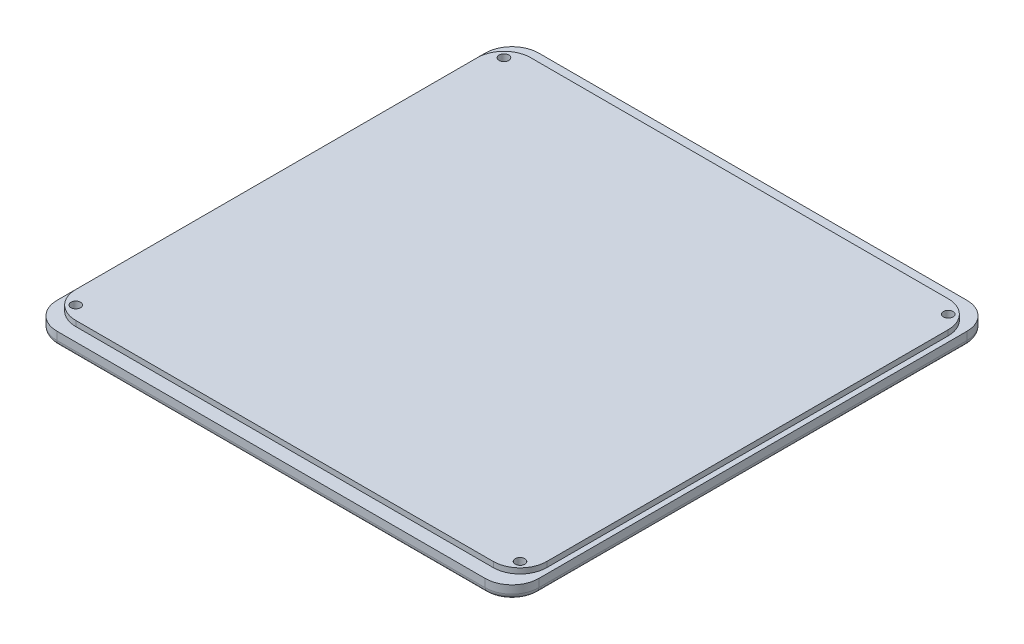
ISO-10303-21;
HEADER;
FILE_DESCRIPTION(('STEP AP214'),'2;1');
FILE_NAME('part.step','',(''),(''),'','','');
FILE_SCHEMA(('AUTOMOTIVE_DESIGN { 1 0 10303 214 1 1 1 1 }'));
ENDSEC;
DATA;
#1=APPLICATION_CONTEXT('core data for automotive mechanical design processes');
#2=APPLICATION_PROTOCOL_DEFINITION('international standard','automotive_design',2000,#1);
#3=PRODUCT_CONTEXT('',#1,'mechanical');
#4=PRODUCT('Part','Part','',(#3));
#5=PRODUCT_RELATED_PRODUCT_CATEGORY('part','',(#4));
#6=PRODUCT_DEFINITION_FORMATION('','',#4);
#7=PRODUCT_DEFINITION_CONTEXT('part definition',#1,'design');
#8=PRODUCT_DEFINITION('design','',#6,#7);
#9=PRODUCT_DEFINITION_SHAPE('','',#8);
#10=(LENGTH_UNIT() NAMED_UNIT(*) SI_UNIT(.MILLI.,.METRE.));
#11=(NAMED_UNIT(*) PLANE_ANGLE_UNIT() SI_UNIT($,.RADIAN.));
#12=(NAMED_UNIT(*) SI_UNIT($,.STERADIAN.) SOLID_ANGLE_UNIT());
#13=UNCERTAINTY_MEASURE_WITH_UNIT(LENGTH_MEASURE(1.E-05),#10,'distance_accuracy_value','');
#14=(GEOMETRIC_REPRESENTATION_CONTEXT(3) GLOBAL_UNCERTAINTY_ASSIGNED_CONTEXT((#13)) GLOBAL_UNIT_ASSIGNED_CONTEXT((#10,
#11,#12)) REPRESENTATION_CONTEXT('',''));
#15=CARTESIAN_POINT('',(0.,0.,0.));
#16=DIRECTION('',(0.,0.,1.));
#17=DIRECTION('',(1.,0.,0.));
#18=AXIS2_PLACEMENT_3D('',#15,#16,#17);
#19=CARTESIAN_POINT('',(90.,5.,-90.));
#20=DIRECTION('',(0.,0.,1.));
#21=DIRECTION('',(1.,0.,0.));
#22=AXIS2_PLACEMENT_3D('',#19,#20,#21);
#23=PLANE('',#22);
#24=DIRECTION('',(0.,-1.,0.));
#25=VECTOR('',#24,1.);
#26=CARTESIAN_POINT('',(80.,0.,-90.));
#27=LINE('',#26,#25);
#28=CARTESIAN_POINT('',(80.,5.,-90.));
#29=VERTEX_POINT('',#28);
#30=CARTESIAN_POINT('',(80.,2.,-90.));
#31=VERTEX_POINT('',#30);
#32=EDGE_CURVE('E259',#29,#31,#27,.T.);
#33=ORIENTED_EDGE('',*,*,#32,.T.);
#34=DIRECTION('',(-1.,0.,0.));
#35=VECTOR('',#34,1.);
#36=CARTESIAN_POINT('',(90.,2.,-90.));
#37=LINE('',#36,#35);
#38=CARTESIAN_POINT('',(-80.,2.,-90.));
#39=VERTEX_POINT('',#38);
#40=EDGE_CURVE('E284',#31,#39,#37,.T.);
#41=ORIENTED_EDGE('',*,*,#40,.T.);
#42=DIRECTION('',(0.,-1.,0.));
#43=VECTOR('',#42,1.);
#44=CARTESIAN_POINT('',(-80.,5.,-90.));
#45=LINE('',#44,#43);
#46=CARTESIAN_POINT('',(-79.9999999999999,5.,-90.));
#47=VERTEX_POINT('',#46);
#48=EDGE_CURVE('E262',#39,#47,#45,.F.);
#49=ORIENTED_EDGE('',*,*,#48,.T.);
#50=DIRECTION('',(-1.,0.,0.));
#51=VECTOR('',#50,1.);
#52=CARTESIAN_POINT('',(90.,5.,-90.));
#53=LINE('',#52,#51);
#54=EDGE_CURVE('E202',#29,#47,#53,.T.);
#55=ORIENTED_EDGE('',*,*,#54,.F.);
#56=EDGE_LOOP('',(#33,#41,#49,#55));
#57=FACE_BOUND('',#56,.T.);
#58=ADVANCED_FACE('F38',(#57),#23,.F.);
#59=CARTESIAN_POINT('',(-90.,5.,-90.));
#60=DIRECTION('',(1.,0.,0.));
#61=DIRECTION('',(0.,0.,-1.));
#62=AXIS2_PLACEMENT_3D('',#59,#60,#61);
#63=PLANE('',#62);
#64=DIRECTION('',(0.,-1.,0.));
#65=VECTOR('',#64,1.);
#66=CARTESIAN_POINT('',(-90.,5.,-80.));
#67=LINE('',#66,#65);
#68=CARTESIAN_POINT('',(-90.,5.,-80.));
#69=VERTEX_POINT('',#68);
#70=CARTESIAN_POINT('',(-90.,2.,-80.));
#71=VERTEX_POINT('',#70);
#72=EDGE_CURVE('E254',#69,#71,#67,.T.);
#73=ORIENTED_EDGE('',*,*,#72,.T.);
#74=DIRECTION('',(0.,0.,1.));
#75=VECTOR('',#74,1.);
#76=CARTESIAN_POINT('',(-90.,2.,-90.));
#77=LINE('',#76,#75);
#78=CARTESIAN_POINT('',(-90.,2.,80.));
#79=VERTEX_POINT('',#78);
#80=EDGE_CURVE('E288',#71,#79,#77,.T.);
#81=ORIENTED_EDGE('',*,*,#80,.T.);
#82=DIRECTION('',(0.,-1.,0.));
#83=VECTOR('',#82,1.);
#84=CARTESIAN_POINT('',(-90.,5.,80.));
#85=LINE('',#84,#83);
#86=CARTESIAN_POINT('',(-90.,5.,79.9999999999999));
#87=VERTEX_POINT('',#86);
#88=EDGE_CURVE('E257',#79,#87,#85,.F.);
#89=ORIENTED_EDGE('',*,*,#88,.T.);
#90=DIRECTION('',(0.,0.,1.));
#91=VECTOR('',#90,1.);
#92=CARTESIAN_POINT('',(-90.,5.,-90.));
#93=LINE('',#92,#91);
#94=EDGE_CURVE('E205',#69,#87,#93,.T.);
#95=ORIENTED_EDGE('',*,*,#94,.F.);
#96=EDGE_LOOP('',(#73,#81,#89,#95));
#97=FACE_BOUND('',#96,.T.);
#98=ADVANCED_FACE('F430',(#97),#63,.F.);
#99=CARTESIAN_POINT('',(90.,5.,90.));
#100=DIRECTION('',(0.,0.,1.));
#101=DIRECTION('',(1.,0.,0.));
#102=AXIS2_PLACEMENT_3D('',#99,#100,#101);
#103=PLANE('',#102);
#104=DIRECTION('',(0.,-1.,0.));
#105=VECTOR('',#104,1.);
#106=CARTESIAN_POINT('',(-80.,0.,90.));
#107=LINE('',#106,#105);
#108=CARTESIAN_POINT('',(-79.9999999999999,5.,90.));
#109=VERTEX_POINT('',#108);
#110=CARTESIAN_POINT('',(-80.,2.,90.));
#111=VERTEX_POINT('',#110);
#112=EDGE_CURVE('E242',#109,#111,#107,.T.);
#113=ORIENTED_EDGE('',*,*,#112,.T.);
#114=DIRECTION('',(-1.,0.,0.));
#115=VECTOR('',#114,1.);
#116=CARTESIAN_POINT('',(80.,2.,90.));
#117=LINE('',#116,#115);
#118=CARTESIAN_POINT('',(80.,2.,90.));
#119=VERTEX_POINT('',#118);
#120=EDGE_CURVE('E62',#111,#119,#117,.F.);
#121=ORIENTED_EDGE('',*,*,#120,.T.);
#122=DIRECTION('',(0.,-1.,0.));
#123=VECTOR('',#122,1.);
#124=CARTESIAN_POINT('',(80.,5.,90.));
#125=LINE('',#124,#123);
#126=CARTESIAN_POINT('',(80.,5.,90.));
#127=VERTEX_POINT('',#126);
#128=EDGE_CURVE('E244',#119,#127,#125,.F.);
#129=ORIENTED_EDGE('',*,*,#128,.T.);
#130=DIRECTION('',(-1.,0.,0.));
#131=VECTOR('',#130,1.);
#132=CARTESIAN_POINT('',(90.,5.,90.));
#133=LINE('',#132,#131);
#134=EDGE_CURVE('E213',#127,#109,#133,.T.);
#135=ORIENTED_EDGE('',*,*,#134,.T.);
#136=EDGE_LOOP('',(#113,#121,#129,#135));
#137=FACE_BOUND('',#136,.T.);
#138=ADVANCED_FACE('F436',(#137),#103,.T.);
#139=CARTESIAN_POINT('',(90.,5.,-90.));
#140=DIRECTION('',(1.,0.,0.));
#141=DIRECTION('',(0.,0.,-1.));
#142=AXIS2_PLACEMENT_3D('',#139,#140,#141);
#143=PLANE('',#142);
#144=DIRECTION('',(0.,-1.,0.));
#145=VECTOR('',#144,1.);
#146=CARTESIAN_POINT('',(90.,5.,80.));
#147=LINE('',#146,#145);
#148=CARTESIAN_POINT('',(90.,5.,79.9999999999999));
#149=VERTEX_POINT('',#148);
#150=CARTESIAN_POINT('',(90.,2.,80.));
#151=VERTEX_POINT('',#150);
#152=EDGE_CURVE('E240',#149,#151,#147,.T.);
#153=ORIENTED_EDGE('',*,*,#152,.T.);
#154=DIRECTION('',(0.,0.,1.));
#155=VECTOR('',#154,1.);
#156=CARTESIAN_POINT('',(90.,2.,-80.));
#157=LINE('',#156,#155);
#158=CARTESIAN_POINT('',(90.,2.,-80.));
#159=VERTEX_POINT('',#158);
#160=EDGE_CURVE('E11',#151,#159,#157,.F.);
#161=ORIENTED_EDGE('',*,*,#160,.T.);
#162=DIRECTION('',(0.,-1.,0.));
#163=VECTOR('',#162,1.);
#164=CARTESIAN_POINT('',(90.,5.,-80.));
#165=LINE('',#164,#163);
#166=CARTESIAN_POINT('',(90.,5.,-80.));
#167=VERTEX_POINT('',#166);
#168=EDGE_CURVE('E219',#159,#167,#165,.F.);
#169=ORIENTED_EDGE('',*,*,#168,.T.);
#170=DIRECTION('',(0.,0.,1.));
#171=VECTOR('',#170,1.);
#172=CARTESIAN_POINT('',(90.,5.,-90.));
#173=LINE('',#172,#171);
#174=EDGE_CURVE('E216',#167,#149,#173,.T.);
#175=ORIENTED_EDGE('',*,*,#174,.T.);
#176=EDGE_LOOP('',(#153,#161,#169,#175));
#177=FACE_BOUND('',#176,.T.);
#178=ADVANCED_FACE('F497',(#177),#143,.T.);
#179=CARTESIAN_POINT('',(0.,5.,0.));
#180=DIRECTION('',(0.,1.,0.));
#181=DIRECTION('',(0.,0.,1.));
#182=AXIS2_PLACEMENT_3D('',#179,#180,#181);
#183=PLANE('',#182);
#184=CARTESIAN_POINT('',(-78.,5.,75.));
#185=DIRECTION('',(0.,1.,0.));
#186=DIRECTION('',(0.,0.,-1.));
#187=AXIS2_PLACEMENT_3D('',#184,#185,#186);
#188=CIRCLE('',#187,9.99999999999999);
#189=CARTESIAN_POINT('',(-88.,5.,74.9999999999999));
#190=VERTEX_POINT('',#189);
#191=CARTESIAN_POINT('',(-77.9999999999999,5.,85.));
#192=VERTEX_POINT('',#191);
#193=EDGE_CURVE('E201',#190,#192,#188,.T.);
#194=ORIENTED_EDGE('',*,*,#193,.F.);
#195=DIRECTION('',(0.,0.,1.));
#196=VECTOR('',#195,1.);
#197=CARTESIAN_POINT('',(-88.,5.,-74.9999999999999));
#198=LINE('',#197,#196);
#199=CARTESIAN_POINT('',(-88.,5.,-74.9999999999999));
#200=VERTEX_POINT('',#199);
#201=EDGE_CURVE('E198',#200,#190,#198,.T.);
#202=ORIENTED_EDGE('',*,*,#201,.F.);
#203=CARTESIAN_POINT('',(-78.,5.,-75.));
#204=DIRECTION('',(0.,1.,0.));
#205=DIRECTION('',(0.,0.,1.));
#206=AXIS2_PLACEMENT_3D('',#203,#204,#205);
#207=CIRCLE('',#206,9.99999999999999);
#208=CARTESIAN_POINT('',(-77.9999999999999,5.,-85.));
#209=VERTEX_POINT('',#208);
#210=EDGE_CURVE('E377',#209,#200,#207,.T.);
#211=ORIENTED_EDGE('',*,*,#210,.F.);
#212=DIRECTION('',(-1.,0.,0.));
#213=VECTOR('',#212,1.);
#214=CARTESIAN_POINT('',(77.9999999999999,5.,-85.));
#215=LINE('',#214,#213);
#216=CARTESIAN_POINT('',(77.9999999999999,5.,-85.));
#217=VERTEX_POINT('',#216);
#218=EDGE_CURVE('E374',#217,#209,#215,.T.);
#219=ORIENTED_EDGE('',*,*,#218,.F.);
#220=CARTESIAN_POINT('',(78.,5.,-75.));
#221=DIRECTION('',(0.,1.,0.));
#222=DIRECTION('',(0.,0.,-1.));
#223=AXIS2_PLACEMENT_3D('',#220,#221,#222);
#224=CIRCLE('',#223,9.99999999999999);
#225=CARTESIAN_POINT('',(88.,5.,-75.));
#226=VERTEX_POINT('',#225);
#227=EDGE_CURVE('E371',#226,#217,#224,.T.);
#228=ORIENTED_EDGE('',*,*,#227,.F.);
#229=DIRECTION('',(0.,0.,-1.));
#230=VECTOR('',#229,1.);
#231=CARTESIAN_POINT('',(88.,5.,-75.));
#232=LINE('',#231,#230);
#233=CARTESIAN_POINT('',(88.,5.,74.9999999999999));
#234=VERTEX_POINT('',#233);
#235=EDGE_CURVE('E368',#234,#226,#232,.T.);
#236=ORIENTED_EDGE('',*,*,#235,.F.);
#237=CARTESIAN_POINT('',(78.,5.,75.));
#238=DIRECTION('',(0.,1.,0.));
#239=DIRECTION('',(0.,0.,-1.));
#240=AXIS2_PLACEMENT_3D('',#237,#238,#239);
#241=CIRCLE('',#240,9.99999999999999);
#242=CARTESIAN_POINT('',(77.9999999999999,5.,85.));
#243=VERTEX_POINT('',#242);
#244=EDGE_CURVE('E365',#243,#234,#241,.T.);
#245=ORIENTED_EDGE('',*,*,#244,.F.);
#246=DIRECTION('',(1.,0.,0.));
#247=VECTOR('',#246,1.);
#248=CARTESIAN_POINT('',(77.9999999999999,5.,85.));
#249=LINE('',#248,#247);
#250=EDGE_CURVE('E363',#192,#243,#249,.T.);
#251=ORIENTED_EDGE('',*,*,#250,.F.);
#252=EDGE_LOOP('',(#194,#202,#211,#219,#228,#236,#245,#251));
#253=FACE_BOUND('',#252,.T.);
#254=ORIENTED_EDGE('',*,*,#134,.F.);
#255=CARTESIAN_POINT('',(80.,5.,80.));
#256=DIRECTION('',(0.,1.,0.));
#257=DIRECTION('',(0.,0.,1.));
#258=AXIS2_PLACEMENT_3D('',#255,#256,#257);
#259=CIRCLE('',#258,10.);
#260=EDGE_CURVE('E252',#127,#149,#259,.T.);
#261=ORIENTED_EDGE('',*,*,#260,.T.);
#262=ORIENTED_EDGE('',*,*,#174,.F.);
#263=CARTESIAN_POINT('',(80.,5.,-80.));
#264=DIRECTION('',(0.,1.,0.));
#265=DIRECTION('',(0.,0.,1.));
#266=AXIS2_PLACEMENT_3D('',#263,#264,#265);
#267=CIRCLE('',#266,10.);
#268=EDGE_CURVE('E246',#167,#29,#267,.T.);
#269=ORIENTED_EDGE('',*,*,#268,.T.);
#270=ORIENTED_EDGE('',*,*,#54,.T.);
#271=CARTESIAN_POINT('',(-80.,5.,-80.));
#272=DIRECTION('',(0.,1.,0.));
#273=DIRECTION('',(0.,0.,1.));
#274=AXIS2_PLACEMENT_3D('',#271,#272,#273);
#275=CIRCLE('',#274,10.);
#276=EDGE_CURVE('E248',#47,#69,#275,.T.);
#277=ORIENTED_EDGE('',*,*,#276,.T.);
#278=ORIENTED_EDGE('',*,*,#94,.T.);
#279=CARTESIAN_POINT('',(-80.,5.,80.));
#280=DIRECTION('',(0.,1.,0.));
#281=DIRECTION('',(0.,0.,1.));
#282=AXIS2_PLACEMENT_3D('',#279,#280,#281);
#283=CIRCLE('',#282,10.);
#284=EDGE_CURVE('E250',#87,#109,#283,.T.);
#285=ORIENTED_EDGE('',*,*,#284,.T.);
#286=EDGE_LOOP('',(#254,#261,#262,#269,#270,#277,#278,#285));
#287=FACE_BOUND('',#286,.T.);
#288=ADVANCED_FACE('F403',(#253,#287),#183,.T.);
#289=CARTESIAN_POINT('',(0.,0.,0.));
#290=DIRECTION('',(0.,1.,0.));
#291=DIRECTION('',(0.,0.,1.));
#292=AXIS2_PLACEMENT_3D('',#289,#290,#291);
#293=PLANE('',#292);
#294=DIRECTION('',(-1.,0.,0.));
#295=VECTOR('',#294,1.);
#296=CARTESIAN_POINT('',(0.,0.,-88.));
#297=LINE('',#296,#295);
#298=CARTESIAN_POINT('',(-80.,0.,-88.));
#299=VERTEX_POINT('',#298);
#300=CARTESIAN_POINT('',(80.,0.,-88.));
#301=VERTEX_POINT('',#300);
#302=EDGE_CURVE('E276',#299,#301,#297,.F.);
#303=ORIENTED_EDGE('',*,*,#302,.T.);
#304=CARTESIAN_POINT('',(80.,0.,-80.));
#305=DIRECTION('',(0.,1.,0.));
#306=DIRECTION('',(0.,0.,1.));
#307=AXIS2_PLACEMENT_3D('',#304,#305,#306);
#308=CIRCLE('',#307,8.);
#309=CARTESIAN_POINT('',(88.,0.,-80.));
#310=VERTEX_POINT('',#309);
#311=EDGE_CURVE('E278',#301,#310,#308,.F.);
#312=ORIENTED_EDGE('',*,*,#311,.T.);
#313=DIRECTION('',(0.,0.,1.));
#314=VECTOR('',#313,1.);
#315=CARTESIAN_POINT('',(88.,0.,79.9999999999999));
#316=LINE('',#315,#314);
#317=CARTESIAN_POINT('',(88.,0.,80.));
#318=VERTEX_POINT('',#317);
#319=EDGE_CURVE('E264',#310,#318,#316,.T.);
#320=ORIENTED_EDGE('',*,*,#319,.T.);
#321=CARTESIAN_POINT('',(80.,0.,80.));
#322=DIRECTION('',(0.,1.,0.));
#323=DIRECTION('',(0.,0.,1.));
#324=AXIS2_PLACEMENT_3D('',#321,#322,#323);
#325=CIRCLE('',#324,8.);
#326=CARTESIAN_POINT('',(80.,0.,88.));
#327=VERTEX_POINT('',#326);
#328=EDGE_CURVE('E266',#318,#327,#325,.F.);
#329=ORIENTED_EDGE('',*,*,#328,.T.);
#330=DIRECTION('',(-1.,0.,0.));
#331=VECTOR('',#330,1.);
#332=CARTESIAN_POINT('',(-79.9999999999999,0.,88.));
#333=LINE('',#332,#331);
#334=CARTESIAN_POINT('',(-80.,0.,88.));
#335=VERTEX_POINT('',#334);
#336=EDGE_CURVE('E268',#327,#335,#333,.T.);
#337=ORIENTED_EDGE('',*,*,#336,.T.);
#338=CARTESIAN_POINT('',(-80.,0.,80.));
#339=DIRECTION('',(0.,1.,0.));
#340=DIRECTION('',(0.,0.,1.));
#341=AXIS2_PLACEMENT_3D('',#338,#339,#340);
#342=CIRCLE('',#341,8.);
#343=CARTESIAN_POINT('',(-88.,0.,80.));
#344=VERTEX_POINT('',#343);
#345=EDGE_CURVE('E270',#335,#344,#342,.F.);
#346=ORIENTED_EDGE('',*,*,#345,.T.);
#347=DIRECTION('',(0.,0.,1.));
#348=VECTOR('',#347,1.);
#349=CARTESIAN_POINT('',(-88.,0.,0.));
#350=LINE('',#349,#348);
#351=CARTESIAN_POINT('',(-88.,0.,-80.));
#352=VERTEX_POINT('',#351);
#353=EDGE_CURVE('E272',#344,#352,#350,.F.);
#354=ORIENTED_EDGE('',*,*,#353,.T.);
#355=CARTESIAN_POINT('',(-80.,0.,-80.));
#356=DIRECTION('',(0.,1.,0.));
#357=DIRECTION('',(0.,0.,1.));
#358=AXIS2_PLACEMENT_3D('',#355,#356,#357);
#359=CIRCLE('',#358,8.);
#360=EDGE_CURVE('E274',#352,#299,#359,.F.);
#361=ORIENTED_EDGE('',*,*,#360,.T.);
#362=EDGE_LOOP('',(#303,#312,#320,#329,#337,#346,#354,#361));
#363=FACE_BOUND('',#362,.T.);
#364=CARTESIAN_POINT('',(83.,0.,-80.));
#365=DIRECTION('',(0.,-1.,0.));
#366=DIRECTION('',(0.,0.,-1.));
#367=AXIS2_PLACEMENT_3D('',#364,#365,#366);
#368=CIRCLE('',#367,3.24999999999999);
#369=CARTESIAN_POINT('',(83.,0.,-83.25));
#370=VERTEX_POINT('',#369);
#371=EDGE_CURVE('E315',#370,#370,#368,.T.);
#372=ORIENTED_EDGE('',*,*,#371,.F.);
#373=EDGE_LOOP('',(#372));
#374=FACE_BOUND('',#373,.T.);
#375=CARTESIAN_POINT('',(-83.,0.,-80.));
#376=DIRECTION('',(0.,-1.,0.));
#377=DIRECTION('',(0.,0.,-1.));
#378=AXIS2_PLACEMENT_3D('',#375,#376,#377);
#379=CIRCLE('',#378,3.24999999999999);
#380=CARTESIAN_POINT('',(-83.,0.,-83.25));
#381=VERTEX_POINT('',#380);
#382=EDGE_CURVE('E237',#381,#381,#379,.T.);
#383=ORIENTED_EDGE('',*,*,#382,.F.);
#384=EDGE_LOOP('',(#383));
#385=FACE_BOUND('',#384,.T.);
#386=CARTESIAN_POINT('',(-83.,0.,80.));
#387=DIRECTION('',(0.,-1.,0.));
#388=DIRECTION('',(0.,0.,-1.));
#389=AXIS2_PLACEMENT_3D('',#386,#387,#388);
#390=CIRCLE('',#389,3.24999999999999);
#391=CARTESIAN_POINT('',(-83.,0.,76.75));
#392=VERTEX_POINT('',#391);
#393=EDGE_CURVE('E232',#392,#392,#390,.T.);
#394=ORIENTED_EDGE('',*,*,#393,.F.);
#395=EDGE_LOOP('',(#394));
#396=FACE_BOUND('',#395,.T.);
#397=CARTESIAN_POINT('',(83.,0.,80.));
#398=DIRECTION('',(0.,-1.,0.));
#399=DIRECTION('',(0.,0.,-1.));
#400=AXIS2_PLACEMENT_3D('',#397,#398,#399);
#401=CIRCLE('',#400,3.24999999999999);
#402=CARTESIAN_POINT('',(83.,0.,76.75));
#403=VERTEX_POINT('',#402);
#404=EDGE_CURVE('E227',#403,#403,#401,.T.);
#405=ORIENTED_EDGE('',*,*,#404,.F.);
#406=EDGE_LOOP('',(#405));
#407=FACE_BOUND('',#406,.T.);
#408=ADVANCED_FACE('F526',(#363,#374,#385,#396,#407),#293,.F.);
#409=CARTESIAN_POINT('',(-78.,7.,75.));
#410=DIRECTION('',(0.,-1.,0.));
#411=DIRECTION('',(0.,0.,-1.));
#412=AXIS2_PLACEMENT_3D('',#409,#410,#411);
#413=CYLINDRICAL_SURFACE('',#412,9.99999999999999);
#414=ORIENTED_EDGE('',*,*,#193,.T.);
#415=DIRECTION('',(0.,-1.,0.));
#416=VECTOR('',#415,1.);
#417=CARTESIAN_POINT('',(-77.9999999999999,7.,85.));
#418=LINE('',#417,#416);
#419=CARTESIAN_POINT('',(-77.9999999999999,7.,85.));
#420=VERTEX_POINT('',#419);
#421=EDGE_CURVE('E182',#420,#192,#418,.T.);
#422=ORIENTED_EDGE('',*,*,#421,.F.);
#423=CARTESIAN_POINT('',(-78.,7.,75.));
#424=DIRECTION('',(0.,1.,0.));
#425=DIRECTION('',(0.,0.,-1.));
#426=AXIS2_PLACEMENT_3D('',#423,#424,#425);
#427=CIRCLE('',#426,9.99999999999999);
#428=CARTESIAN_POINT('',(-88.,7.,74.9999999999999));
#429=VERTEX_POINT('',#428);
#430=EDGE_CURVE('E189',#429,#420,#427,.T.);
#431=ORIENTED_EDGE('',*,*,#430,.F.);
#432=DIRECTION('',(0.,-1.,0.));
#433=VECTOR('',#432,1.);
#434=CARTESIAN_POINT('',(-88.,7.,74.9999999999999));
#435=LINE('',#434,#433);
#436=EDGE_CURVE('E361',#429,#190,#435,.T.);
#437=ORIENTED_EDGE('',*,*,#436,.T.);
#438=EDGE_LOOP('',(#414,#422,#431,#437));
#439=FACE_BOUND('',#438,.T.);
#440=ADVANCED_FACE('F200',(#439),#413,.T.);
#441=CARTESIAN_POINT('',(77.9999999999999,7.,85.));
#442=DIRECTION('',(0.,0.,-1.));
#443=DIRECTION('',(-1.,0.,0.));
#444=AXIS2_PLACEMENT_3D('',#441,#442,#443);
#445=PLANE('',#444);
#446=ORIENTED_EDGE('',*,*,#250,.T.);
#447=DIRECTION('',(0.,-1.,0.));
#448=VECTOR('',#447,1.);
#449=CARTESIAN_POINT('',(77.9999999999999,7.,85.));
#450=LINE('',#449,#448);
#451=CARTESIAN_POINT('',(77.9999999999999,7.,85.));
#452=VERTEX_POINT('',#451);
#453=EDGE_CURVE('E185',#452,#243,#450,.T.);
#454=ORIENTED_EDGE('',*,*,#453,.F.);
#455=DIRECTION('',(1.,0.,0.));
#456=VECTOR('',#455,1.);
#457=CARTESIAN_POINT('',(77.9999999999999,7.,85.));
#458=LINE('',#457,#456);
#459=EDGE_CURVE('E177',#420,#452,#458,.T.);
#460=ORIENTED_EDGE('',*,*,#459,.F.);
#461=ORIENTED_EDGE('',*,*,#421,.T.);
#462=EDGE_LOOP('',(#446,#454,#460,#461));
#463=FACE_BOUND('',#462,.T.);
#464=ADVANCED_FACE('F180',(#463),#445,.F.);
#465=CARTESIAN_POINT('',(78.,7.,75.));
#466=DIRECTION('',(0.,-1.,0.));
#467=DIRECTION('',(0.,0.,-1.));
#468=AXIS2_PLACEMENT_3D('',#465,#466,#467);
#469=CYLINDRICAL_SURFACE('',#468,9.99999999999999);
#470=ORIENTED_EDGE('',*,*,#244,.T.);
#471=DIRECTION('',(0.,-1.,0.));
#472=VECTOR('',#471,1.);
#473=CARTESIAN_POINT('',(88.,7.,74.9999999999999));
#474=LINE('',#473,#472);
#475=CARTESIAN_POINT('',(88.,7.,74.9999999999999));
#476=VERTEX_POINT('',#475);
#477=EDGE_CURVE('E207',#476,#234,#474,.T.);
#478=ORIENTED_EDGE('',*,*,#477,.F.);
#479=CARTESIAN_POINT('',(78.,7.,75.));
#480=DIRECTION('',(0.,1.,0.));
#481=DIRECTION('',(0.,0.,-1.));
#482=AXIS2_PLACEMENT_3D('',#479,#480,#481);
#483=CIRCLE('',#482,9.99999999999999);
#484=EDGE_CURVE('E188',#452,#476,#483,.T.);
#485=ORIENTED_EDGE('',*,*,#484,.F.);
#486=ORIENTED_EDGE('',*,*,#453,.T.);
#487=EDGE_LOOP('',(#470,#478,#485,#486));
#488=FACE_BOUND('',#487,.T.);
#489=ADVANCED_FACE('F401',(#488),#469,.T.);
#490=CARTESIAN_POINT('',(88.,7.,-75.));
#491=DIRECTION('',(-1.,0.,0.));
#492=DIRECTION('',(0.,0.,1.));
#493=AXIS2_PLACEMENT_3D('',#490,#491,#492);
#494=PLANE('',#493);
#495=ORIENTED_EDGE('',*,*,#235,.T.);
#496=DIRECTION('',(0.,-1.,0.));
#497=VECTOR('',#496,1.);
#498=CARTESIAN_POINT('',(88.,7.,-75.));
#499=LINE('',#498,#497);
#500=CARTESIAN_POINT('',(88.,7.,-75.));
#501=VERTEX_POINT('',#500);
#502=EDGE_CURVE('E392',#501,#226,#499,.T.);
#503=ORIENTED_EDGE('',*,*,#502,.F.);
#504=DIRECTION('',(0.,0.,-1.));
#505=VECTOR('',#504,1.);
#506=CARTESIAN_POINT('',(88.,7.,-75.));
#507=LINE('',#506,#505);
#508=EDGE_CURVE('E352',#476,#501,#507,.T.);
#509=ORIENTED_EDGE('',*,*,#508,.F.);
#510=ORIENTED_EDGE('',*,*,#477,.T.);
#511=EDGE_LOOP('',(#495,#503,#509,#510));
#512=FACE_BOUND('',#511,.T.);
#513=ADVANCED_FACE('F398',(#512),#494,.F.);
#514=CARTESIAN_POINT('',(78.,7.,-75.));
#515=DIRECTION('',(0.,-1.,0.));
#516=DIRECTION('',(0.,0.,-1.));
#517=AXIS2_PLACEMENT_3D('',#514,#515,#516);
#518=CYLINDRICAL_SURFACE('',#517,9.99999999999999);
#519=ORIENTED_EDGE('',*,*,#227,.T.);
#520=DIRECTION('',(0.,-1.,0.));
#521=VECTOR('',#520,1.);
#522=CARTESIAN_POINT('',(77.9999999999999,7.,-85.));
#523=LINE('',#522,#521);
#524=CARTESIAN_POINT('',(77.9999999999999,7.,-85.));
#525=VERTEX_POINT('',#524);
#526=EDGE_CURVE('E389',#525,#217,#523,.T.);
#527=ORIENTED_EDGE('',*,*,#526,.F.);
#528=CARTESIAN_POINT('',(78.,7.,-75.));
#529=DIRECTION('',(0.,1.,0.));
#530=DIRECTION('',(0.,0.,-1.));
#531=AXIS2_PLACEMENT_3D('',#528,#529,#530);
#532=CIRCLE('',#531,9.99999999999999);
#533=EDGE_CURVE('E354',#501,#525,#532,.T.);
#534=ORIENTED_EDGE('',*,*,#533,.F.);
#535=ORIENTED_EDGE('',*,*,#502,.T.);
#536=EDGE_LOOP('',(#519,#527,#534,#535));
#537=FACE_BOUND('',#536,.T.);
#538=ADVANCED_FACE('F407',(#537),#518,.T.);
#539=CARTESIAN_POINT('',(77.9999999999999,7.,-85.));
#540=DIRECTION('',(0.,0.,1.));
#541=DIRECTION('',(1.,0.,0.));
#542=AXIS2_PLACEMENT_3D('',#539,#540,#541);
#543=PLANE('',#542);
#544=ORIENTED_EDGE('',*,*,#218,.T.);
#545=DIRECTION('',(0.,-1.,0.));
#546=VECTOR('',#545,1.);
#547=CARTESIAN_POINT('',(-77.9999999999999,7.,-85.));
#548=LINE('',#547,#546);
#549=CARTESIAN_POINT('',(-77.9999999999999,7.,-85.));
#550=VERTEX_POINT('',#549);
#551=EDGE_CURVE('E386',#550,#209,#548,.T.);
#552=ORIENTED_EDGE('',*,*,#551,.F.);
#553=DIRECTION('',(-1.,0.,0.));
#554=VECTOR('',#553,1.);
#555=CARTESIAN_POINT('',(77.9999999999999,7.,-85.));
#556=LINE('',#555,#554);
#557=EDGE_CURVE('E356',#525,#550,#556,.T.);
#558=ORIENTED_EDGE('',*,*,#557,.F.);
#559=ORIENTED_EDGE('',*,*,#526,.T.);
#560=EDGE_LOOP('',(#544,#552,#558,#559));
#561=FACE_BOUND('',#560,.T.);
#562=ADVANCED_FACE('F411',(#561),#543,.F.);
#563=CARTESIAN_POINT('',(-78.,7.,-75.));
#564=DIRECTION('',(0.,-1.,0.));
#565=DIRECTION('',(0.,0.,-1.));
#566=AXIS2_PLACEMENT_3D('',#563,#564,#565);
#567=CYLINDRICAL_SURFACE('',#566,9.99999999999999);
#568=ORIENTED_EDGE('',*,*,#210,.T.);
#569=DIRECTION('',(0.,-1.,0.));
#570=VECTOR('',#569,1.);
#571=CARTESIAN_POINT('',(-88.,7.,-74.9999999999999));
#572=LINE('',#571,#570);
#573=CARTESIAN_POINT('',(-88.,7.,-74.9999999999999));
#574=VERTEX_POINT('',#573);
#575=EDGE_CURVE('E383',#574,#200,#572,.T.);
#576=ORIENTED_EDGE('',*,*,#575,.F.);
#577=CARTESIAN_POINT('',(-78.,7.,-75.));
#578=DIRECTION('',(0.,1.,0.));
#579=DIRECTION('',(0.,0.,1.));
#580=AXIS2_PLACEMENT_3D('',#577,#578,#579);
#581=CIRCLE('',#580,9.99999999999999);
#582=EDGE_CURVE('E358',#550,#574,#581,.T.);
#583=ORIENTED_EDGE('',*,*,#582,.F.);
#584=ORIENTED_EDGE('',*,*,#551,.T.);
#585=EDGE_LOOP('',(#568,#576,#583,#584));
#586=FACE_BOUND('',#585,.T.);
#587=ADVANCED_FACE('F416',(#586),#567,.T.);
#588=CARTESIAN_POINT('',(-88.,7.,-74.9999999999999));
#589=DIRECTION('',(1.,0.,0.));
#590=DIRECTION('',(0.,0.,-1.));
#591=AXIS2_PLACEMENT_3D('',#588,#589,#590);
#592=PLANE('',#591);
#593=ORIENTED_EDGE('',*,*,#201,.T.);
#594=ORIENTED_EDGE('',*,*,#436,.F.);
#595=DIRECTION('',(0.,0.,1.));
#596=VECTOR('',#595,1.);
#597=CARTESIAN_POINT('',(-88.,7.,-74.9999999999999));
#598=LINE('',#597,#596);
#599=EDGE_CURVE('E194',#574,#429,#598,.T.);
#600=ORIENTED_EDGE('',*,*,#599,.F.);
#601=ORIENTED_EDGE('',*,*,#575,.T.);
#602=EDGE_LOOP('',(#593,#594,#600,#601));
#603=FACE_BOUND('',#602,.T.);
#604=ADVANCED_FACE('F418',(#603),#592,.F.);
#605=CARTESIAN_POINT('',(-78.,7.,75.));
#606=DIRECTION('',(0.,-1.,0.));
#607=DIRECTION('',(0.,0.,-1.));
#608=AXIS2_PLACEMENT_3D('',#605,#606,#607);
#609=PLANE('',#608);
#610=CARTESIAN_POINT('',(83.,7.,-80.));
#611=DIRECTION('',(0.,-1.,0.));
#612=DIRECTION('',(0.,0.,-1.));
#613=AXIS2_PLACEMENT_3D('',#610,#611,#612);
#614=CIRCLE('',#613,1.8);
#615=CARTESIAN_POINT('',(83.,7.,-81.8));
#616=VERTEX_POINT('',#615);
#617=EDGE_CURVE('E234',#616,#616,#614,.T.);
#618=ORIENTED_EDGE('',*,*,#617,.T.);
#619=EDGE_LOOP('',(#618));
#620=FACE_BOUND('',#619,.T.);
#621=CARTESIAN_POINT('',(-83.,7.,-80.));
#622=DIRECTION('',(0.,-1.,0.));
#623=DIRECTION('',(0.,0.,-1.));
#624=AXIS2_PLACEMENT_3D('',#621,#622,#623);
#625=CIRCLE('',#624,1.8);
#626=CARTESIAN_POINT('',(-83.,7.,-81.8));
#627=VERTEX_POINT('',#626);
#628=EDGE_CURVE('E229',#627,#627,#625,.T.);
#629=ORIENTED_EDGE('',*,*,#628,.T.);
#630=EDGE_LOOP('',(#629));
#631=FACE_BOUND('',#630,.T.);
#632=CARTESIAN_POINT('',(-83.,7.,80.));
#633=DIRECTION('',(0.,-1.,0.));
#634=DIRECTION('',(0.,0.,-1.));
#635=AXIS2_PLACEMENT_3D('',#632,#633,#634);
#636=CIRCLE('',#635,1.8);
#637=CARTESIAN_POINT('',(-83.,7.,78.2));
#638=VERTEX_POINT('',#637);
#639=EDGE_CURVE('E224',#638,#638,#636,.T.);
#640=ORIENTED_EDGE('',*,*,#639,.T.);
#641=EDGE_LOOP('',(#640));
#642=FACE_BOUND('',#641,.T.);
#643=CARTESIAN_POINT('',(83.,7.,80.));
#644=DIRECTION('',(0.,-1.,0.));
#645=DIRECTION('',(0.,0.,-1.));
#646=AXIS2_PLACEMENT_3D('',#643,#644,#645);
#647=CIRCLE('',#646,1.8);
#648=CARTESIAN_POINT('',(83.,7.,78.2));
#649=VERTEX_POINT('',#648);
#650=EDGE_CURVE('E220',#649,#649,#647,.T.);
#651=ORIENTED_EDGE('',*,*,#650,.T.);
#652=EDGE_LOOP('',(#651));
#653=FACE_BOUND('',#652,.T.);
#654=ORIENTED_EDGE('',*,*,#430,.T.);
#655=ORIENTED_EDGE('',*,*,#459,.T.);
#656=ORIENTED_EDGE('',*,*,#484,.T.);
#657=ORIENTED_EDGE('',*,*,#508,.T.);
#658=ORIENTED_EDGE('',*,*,#533,.T.);
#659=ORIENTED_EDGE('',*,*,#557,.T.);
#660=ORIENTED_EDGE('',*,*,#582,.T.);
#661=ORIENTED_EDGE('',*,*,#599,.T.);
#662=EDGE_LOOP('',(#654,#655,#656,#657,#658,#659,#660,#661));
#663=FACE_BOUND('',#662,.T.);
#664=ADVANCED_FACE('F192',(#620,#631,#642,#653,#663),#609,.F.);
#665=CARTESIAN_POINT('',(83.,0.,80.));
#666=DIRECTION('',(0.,-1.,0.));
#667=DIRECTION('',(0.,0.,-1.));
#668=AXIS2_PLACEMENT_3D('',#665,#666,#667);
#669=CYLINDRICAL_SURFACE('',#668,1.8);
#670=CARTESIAN_POINT('',(83.,3.4,80.));
#671=DIRECTION('',(0.,-1.,0.));
#672=DIRECTION('',(0.,0.,-1.));
#673=AXIS2_PLACEMENT_3D('',#670,#671,#672);
#674=CIRCLE('',#673,1.8);
#675=CARTESIAN_POINT('',(83.,3.4,78.2));
#676=VERTEX_POINT('',#675);
#677=EDGE_CURVE('E223',#676,#676,#674,.T.);
#678=ORIENTED_EDGE('',*,*,#677,.T.);
#679=EDGE_LOOP('',(#678));
#680=FACE_BOUND('',#679,.T.);
#681=ORIENTED_EDGE('',*,*,#650,.F.);
#682=EDGE_LOOP('',(#681));
#683=FACE_BOUND('',#682,.T.);
#684=ADVANCED_FACE('F425',(#680,#683),#669,.F.);
#685=CARTESIAN_POINT('',(84.8,3.4,80.));
#686=DIRECTION('',(0.,1.,0.));
#687=DIRECTION('',(0.,0.,1.));
#688=AXIS2_PLACEMENT_3D('',#685,#686,#687);
#689=PLANE('',#688);
#690=ORIENTED_EDGE('',*,*,#677,.F.);
#691=EDGE_LOOP('',(#690));
#692=FACE_BOUND('',#691,.T.);
#693=CARTESIAN_POINT('',(83.,3.4,80.));
#694=DIRECTION('',(0.,-1.,0.));
#695=DIRECTION('',(0.,0.,-1.));
#696=AXIS2_PLACEMENT_3D('',#693,#694,#695);
#697=CIRCLE('',#696,3.24999999999999);
#698=CARTESIAN_POINT('',(83.,3.4,76.75));
#699=VERTEX_POINT('',#698);
#700=EDGE_CURVE('E346',#699,#699,#697,.T.);
#701=ORIENTED_EDGE('',*,*,#700,.T.);
#702=EDGE_LOOP('',(#701));
#703=FACE_BOUND('',#702,.T.);
#704=ADVANCED_FACE('F573',(#692,#703),#689,.F.);
#705=CARTESIAN_POINT('',(83.,0.,80.));
#706=DIRECTION('',(0.,-1.,0.));
#707=DIRECTION('',(0.,0.,-1.));
#708=AXIS2_PLACEMENT_3D('',#705,#706,#707);
#709=CYLINDRICAL_SURFACE('',#708,3.24999999999999);
#710=ORIENTED_EDGE('',*,*,#700,.F.);
#711=EDGE_LOOP('',(#710));
#712=FACE_BOUND('',#711,.T.);
#713=ORIENTED_EDGE('',*,*,#404,.T.);
#714=EDGE_LOOP('',(#713));
#715=FACE_BOUND('',#714,.T.);
#716=ADVANCED_FACE('F584',(#712,#715),#709,.F.);
#717=CARTESIAN_POINT('',(-83.,0.,80.));
#718=DIRECTION('',(0.,-1.,0.));
#719=DIRECTION('',(0.,0.,-1.));
#720=AXIS2_PLACEMENT_3D('',#717,#718,#719);
#721=CYLINDRICAL_SURFACE('',#720,1.8);
#722=CARTESIAN_POINT('',(-83.,3.4,80.));
#723=DIRECTION('',(0.,-1.,0.));
#724=DIRECTION('',(0.,0.,-1.));
#725=AXIS2_PLACEMENT_3D('',#722,#723,#724);
#726=CIRCLE('',#725,1.8);
#727=CARTESIAN_POINT('',(-83.,3.4,78.2));
#728=VERTEX_POINT('',#727);
#729=EDGE_CURVE('E228',#728,#728,#726,.T.);
#730=ORIENTED_EDGE('',*,*,#729,.T.);
#731=EDGE_LOOP('',(#730));
#732=FACE_BOUND('',#731,.T.);
#733=ORIENTED_EDGE('',*,*,#639,.F.);
#734=EDGE_LOOP('',(#733));
#735=FACE_BOUND('',#734,.T.);
#736=ADVANCED_FACE('F595',(#732,#735),#721,.F.);
#737=CARTESIAN_POINT('',(-81.2,3.4,80.));
#738=DIRECTION('',(0.,1.,0.));
#739=DIRECTION('',(0.,0.,1.));
#740=AXIS2_PLACEMENT_3D('',#737,#738,#739);
#741=PLANE('',#740);
#742=ORIENTED_EDGE('',*,*,#729,.F.);
#743=EDGE_LOOP('',(#742));
#744=FACE_BOUND('',#743,.T.);
#745=CARTESIAN_POINT('',(-83.,3.4,80.));
#746=DIRECTION('',(0.,-1.,0.));
#747=DIRECTION('',(0.,0.,-1.));
#748=AXIS2_PLACEMENT_3D('',#745,#746,#747);
#749=CIRCLE('',#748,3.24999999999999);
#750=CARTESIAN_POINT('',(-83.,3.4,76.75));
#751=VERTEX_POINT('',#750);
#752=EDGE_CURVE('E339',#751,#751,#749,.T.);
#753=ORIENTED_EDGE('',*,*,#752,.T.);
#754=EDGE_LOOP('',(#753));
#755=FACE_BOUND('',#754,.T.);
#756=ADVANCED_FACE('F606',(#744,#755),#741,.F.);
#757=CARTESIAN_POINT('',(-83.,0.,80.));
#758=DIRECTION('',(0.,-1.,0.));
#759=DIRECTION('',(0.,0.,-1.));
#760=AXIS2_PLACEMENT_3D('',#757,#758,#759);
#761=CYLINDRICAL_SURFACE('',#760,3.24999999999999);
#762=ORIENTED_EDGE('',*,*,#752,.F.);
#763=EDGE_LOOP('',(#762));
#764=FACE_BOUND('',#763,.T.);
#765=ORIENTED_EDGE('',*,*,#393,.T.);
#766=EDGE_LOOP('',(#765));
#767=FACE_BOUND('',#766,.T.);
#768=ADVANCED_FACE('F617',(#764,#767),#761,.F.);
#769=CARTESIAN_POINT('',(-83.,0.,-80.));
#770=DIRECTION('',(0.,-1.,0.));
#771=DIRECTION('',(0.,0.,-1.));
#772=AXIS2_PLACEMENT_3D('',#769,#770,#771);
#773=CYLINDRICAL_SURFACE('',#772,1.8);
#774=CARTESIAN_POINT('',(-83.,3.4,-80.));
#775=DIRECTION('',(0.,-1.,0.));
#776=DIRECTION('',(0.,0.,-1.));
#777=AXIS2_PLACEMENT_3D('',#774,#775,#776);
#778=CIRCLE('',#777,1.8);
#779=CARTESIAN_POINT('',(-83.,3.4,-81.8));
#780=VERTEX_POINT('',#779);
#781=EDGE_CURVE('E233',#780,#780,#778,.T.);
#782=ORIENTED_EDGE('',*,*,#781,.T.);
#783=EDGE_LOOP('',(#782));
#784=FACE_BOUND('',#783,.T.);
#785=ORIENTED_EDGE('',*,*,#628,.F.);
#786=EDGE_LOOP('',(#785));
#787=FACE_BOUND('',#786,.T.);
#788=ADVANCED_FACE('F628',(#784,#787),#773,.F.);
#789=CARTESIAN_POINT('',(-81.2,3.4,-80.));
#790=DIRECTION('',(0.,1.,0.));
#791=DIRECTION('',(0.,0.,1.));
#792=AXIS2_PLACEMENT_3D('',#789,#790,#791);
#793=PLANE('',#792);
#794=ORIENTED_EDGE('',*,*,#781,.F.);
#795=EDGE_LOOP('',(#794));
#796=FACE_BOUND('',#795,.T.);
#797=CARTESIAN_POINT('',(-83.,3.4,-80.));
#798=DIRECTION('',(0.,-1.,0.));
#799=DIRECTION('',(0.,0.,-1.));
#800=AXIS2_PLACEMENT_3D('',#797,#798,#799);
#801=CIRCLE('',#800,3.24999999999999);
#802=CARTESIAN_POINT('',(-83.,3.4,-83.25));
#803=VERTEX_POINT('',#802);
#804=EDGE_CURVE('E332',#803,#803,#801,.T.);
#805=ORIENTED_EDGE('',*,*,#804,.T.);
#806=EDGE_LOOP('',(#805));
#807=FACE_BOUND('',#806,.T.);
#808=ADVANCED_FACE('F639',(#796,#807),#793,.F.);
#809=CARTESIAN_POINT('',(-83.,0.,-80.));
#810=DIRECTION('',(0.,-1.,0.));
#811=DIRECTION('',(0.,0.,-1.));
#812=AXIS2_PLACEMENT_3D('',#809,#810,#811);
#813=CYLINDRICAL_SURFACE('',#812,3.24999999999999);
#814=ORIENTED_EDGE('',*,*,#804,.F.);
#815=EDGE_LOOP('',(#814));
#816=FACE_BOUND('',#815,.T.);
#817=ORIENTED_EDGE('',*,*,#382,.T.);
#818=EDGE_LOOP('',(#817));
#819=FACE_BOUND('',#818,.T.);
#820=ADVANCED_FACE('F650',(#816,#819),#813,.F.);
#821=CARTESIAN_POINT('',(83.,0.,-80.));
#822=DIRECTION('',(0.,-1.,0.));
#823=DIRECTION('',(0.,0.,-1.));
#824=AXIS2_PLACEMENT_3D('',#821,#822,#823);
#825=CYLINDRICAL_SURFACE('',#824,1.8);
#826=CARTESIAN_POINT('',(83.,3.4,-80.));
#827=DIRECTION('',(0.,-1.,0.));
#828=DIRECTION('',(0.,0.,-1.));
#829=AXIS2_PLACEMENT_3D('',#826,#827,#828);
#830=CIRCLE('',#829,1.8);
#831=CARTESIAN_POINT('',(83.,3.4,-81.8));
#832=VERTEX_POINT('',#831);
#833=EDGE_CURVE('E238',#832,#832,#830,.T.);
#834=ORIENTED_EDGE('',*,*,#833,.T.);
#835=EDGE_LOOP('',(#834));
#836=FACE_BOUND('',#835,.T.);
#837=ORIENTED_EDGE('',*,*,#617,.F.);
#838=EDGE_LOOP('',(#837));
#839=FACE_BOUND('',#838,.T.);
#840=ADVANCED_FACE('F661',(#836,#839),#825,.F.);
#841=CARTESIAN_POINT('',(84.8,3.4,-80.));
#842=DIRECTION('',(0.,1.,0.));
#843=DIRECTION('',(0.,0.,1.));
#844=AXIS2_PLACEMENT_3D('',#841,#842,#843);
#845=PLANE('',#844);
#846=ORIENTED_EDGE('',*,*,#833,.F.);
#847=EDGE_LOOP('',(#846));
#848=FACE_BOUND('',#847,.T.);
#849=CARTESIAN_POINT('',(83.,3.4,-80.));
#850=DIRECTION('',(0.,-1.,0.));
#851=DIRECTION('',(0.,0.,-1.));
#852=AXIS2_PLACEMENT_3D('',#849,#850,#851);
#853=CIRCLE('',#852,3.24999999999999);
#854=CARTESIAN_POINT('',(83.,3.4,-83.25));
#855=VERTEX_POINT('',#854);
#856=EDGE_CURVE('E321',#855,#855,#853,.T.);
#857=ORIENTED_EDGE('',*,*,#856,.T.);
#858=EDGE_LOOP('',(#857));
#859=FACE_BOUND('',#858,.T.);
#860=ADVANCED_FACE('F672',(#848,#859),#845,.F.);
#861=CARTESIAN_POINT('',(83.,0.,-80.));
#862=DIRECTION('',(0.,-1.,0.));
#863=DIRECTION('',(0.,0.,-1.));
#864=AXIS2_PLACEMENT_3D('',#861,#862,#863);
#865=CYLINDRICAL_SURFACE('',#864,3.24999999999999);
#866=ORIENTED_EDGE('',*,*,#856,.F.);
#867=EDGE_LOOP('',(#866));
#868=FACE_BOUND('',#867,.T.);
#869=ORIENTED_EDGE('',*,*,#371,.T.);
#870=EDGE_LOOP('',(#869));
#871=FACE_BOUND('',#870,.T.);
#872=ADVANCED_FACE('F445',(#868,#871),#865,.F.);
#873=CARTESIAN_POINT('',(80.,5.,80.));
#874=DIRECTION('',(0.,-1.,0.));
#875=DIRECTION('',(0.,0.,-1.));
#876=AXIS2_PLACEMENT_3D('',#873,#874,#875);
#877=CYLINDRICAL_SURFACE('',#876,10.);
#878=ORIENTED_EDGE('',*,*,#128,.F.);
#879=CARTESIAN_POINT('',(80.,2.,80.));
#880=DIRECTION('',(0.,1.,0.));
#881=DIRECTION('',(0.,0.,1.));
#882=AXIS2_PLACEMENT_3D('',#879,#880,#881);
#883=CIRCLE('',#882,10.);
#884=EDGE_CURVE('E47',#119,#151,#883,.T.);
#885=ORIENTED_EDGE('',*,*,#884,.T.);
#886=ORIENTED_EDGE('',*,*,#152,.F.);
#887=ORIENTED_EDGE('',*,*,#260,.F.);
#888=EDGE_LOOP('',(#878,#885,#886,#887));
#889=FACE_BOUND('',#888,.T.);
#890=ADVANCED_FACE('F441',(#889),#877,.T.);
#891=CARTESIAN_POINT('',(-80.,5.,80.));
#892=DIRECTION('',(0.,1.,0.));
#893=DIRECTION('',(0.,0.,1.));
#894=AXIS2_PLACEMENT_3D('',#891,#892,#893);
#895=CYLINDRICAL_SURFACE('',#894,10.);
#896=ORIENTED_EDGE('',*,*,#88,.F.);
#897=CARTESIAN_POINT('',(-80.,2.,80.));
#898=DIRECTION('',(0.,1.,0.));
#899=DIRECTION('',(0.,0.,1.));
#900=AXIS2_PLACEMENT_3D('',#897,#898,#899);
#901=CIRCLE('',#900,10.);
#902=EDGE_CURVE('E290',#79,#111,#901,.T.);
#903=ORIENTED_EDGE('',*,*,#902,.T.);
#904=ORIENTED_EDGE('',*,*,#112,.F.);
#905=ORIENTED_EDGE('',*,*,#284,.F.);
#906=EDGE_LOOP('',(#896,#903,#904,#905));
#907=FACE_BOUND('',#906,.T.);
#908=ADVANCED_FACE('F444',(#907),#895,.T.);
#909=CARTESIAN_POINT('',(-80.,5.,-80.));
#910=DIRECTION('',(0.,-1.,0.));
#911=DIRECTION('',(0.,0.,-1.));
#912=AXIS2_PLACEMENT_3D('',#909,#910,#911);
#913=CYLINDRICAL_SURFACE('',#912,10.);
#914=ORIENTED_EDGE('',*,*,#48,.F.);
#915=CARTESIAN_POINT('',(-80.,2.,-80.));
#916=DIRECTION('',(0.,1.,0.));
#917=DIRECTION('',(0.,0.,1.));
#918=AXIS2_PLACEMENT_3D('',#915,#916,#917);
#919=CIRCLE('',#918,10.);
#920=EDGE_CURVE('E286',#39,#71,#919,.T.);
#921=ORIENTED_EDGE('',*,*,#920,.T.);
#922=ORIENTED_EDGE('',*,*,#72,.F.);
#923=ORIENTED_EDGE('',*,*,#276,.F.);
#924=EDGE_LOOP('',(#914,#921,#922,#923));
#925=FACE_BOUND('',#924,.T.);
#926=ADVANCED_FACE('F448',(#925),#913,.T.);
#927=CARTESIAN_POINT('',(80.,5.,-80.));
#928=DIRECTION('',(0.,1.,0.));
#929=DIRECTION('',(0.,0.,1.));
#930=AXIS2_PLACEMENT_3D('',#927,#928,#929);
#931=CYLINDRICAL_SURFACE('',#930,10.);
#932=ORIENTED_EDGE('',*,*,#168,.F.);
#933=CARTESIAN_POINT('',(80.,2.,-80.));
#934=DIRECTION('',(0.,1.,0.));
#935=DIRECTION('',(0.,0.,1.));
#936=AXIS2_PLACEMENT_3D('',#933,#934,#935);
#937=CIRCLE('',#936,10.);
#938=EDGE_CURVE('E281',#159,#31,#937,.T.);
#939=ORIENTED_EDGE('',*,*,#938,.T.);
#940=ORIENTED_EDGE('',*,*,#32,.F.);
#941=ORIENTED_EDGE('',*,*,#268,.F.);
#942=EDGE_LOOP('',(#932,#939,#940,#941));
#943=FACE_BOUND('',#942,.T.);
#944=ADVANCED_FACE('F452',(#943),#931,.T.);
#945=CARTESIAN_POINT('',(-80.,2.,80.));
#946=DIRECTION('',(0.,1.,0.));
#947=DIRECTION('',(0.,0.,1.));
#948=AXIS2_PLACEMENT_3D('',#945,#946,#947);
#949=TOROIDAL_SURFACE('',#948,8.,2.);
#950=CARTESIAN_POINT('',(-80.,2.,88.));
#951=DIRECTION('',(1.,0.,0.));
#952=DIRECTION('',(0.,0.,-1.));
#953=AXIS2_PLACEMENT_3D('',#950,#951,#952);
#954=CIRCLE('',#953,2.);
#955=EDGE_CURVE('E309',#111,#335,#954,.T.);
#956=ORIENTED_EDGE('',*,*,#955,.F.);
#957=ORIENTED_EDGE('',*,*,#902,.F.);
#958=CARTESIAN_POINT('',(-88.,2.,80.));
#959=DIRECTION('',(0.,0.,-1.));
#960=DIRECTION('',(-1.,0.,0.));
#961=AXIS2_PLACEMENT_3D('',#958,#959,#960);
#962=CIRCLE('',#961,2.);
#963=EDGE_CURVE('E42',#344,#79,#962,.T.);
#964=ORIENTED_EDGE('',*,*,#963,.F.);
#965=ORIENTED_EDGE('',*,*,#345,.F.);
#966=EDGE_LOOP('',(#956,#957,#964,#965));
#967=FACE_BOUND('',#966,.T.);
#968=ADVANCED_FACE('F40',(#967),#949,.T.);
#969=CARTESIAN_POINT('',(-88.,2.,-90.));
#970=DIRECTION('',(0.,0.,1.));
#971=DIRECTION('',(1.,0.,0.));
#972=AXIS2_PLACEMENT_3D('',#969,#970,#971);
#973=CYLINDRICAL_SURFACE('',#972,2.);
#974=ORIENTED_EDGE('',*,*,#963,.T.);
#975=ORIENTED_EDGE('',*,*,#80,.F.);
#976=CARTESIAN_POINT('',(-88.,2.,-80.));
#977=DIRECTION('',(0.,0.,-1.));
#978=DIRECTION('',(-1.,0.,0.));
#979=AXIS2_PLACEMENT_3D('',#976,#977,#978);
#980=CIRCLE('',#979,2.);
#981=EDGE_CURVE('E307',#352,#71,#980,.T.);
#982=ORIENTED_EDGE('',*,*,#981,.F.);
#983=ORIENTED_EDGE('',*,*,#353,.F.);
#984=EDGE_LOOP('',(#974,#975,#982,#983));
#985=FACE_BOUND('',#984,.T.);
#986=ADVANCED_FACE('F479',(#985),#973,.T.);
#987=CARTESIAN_POINT('',(0.,2.,88.));
#988=DIRECTION('',(1.,0.,0.));
#989=DIRECTION('',(0.,0.,-1.));
#990=AXIS2_PLACEMENT_3D('',#987,#988,#989);
#991=CYLINDRICAL_SURFACE('',#990,2.);
#992=ORIENTED_EDGE('',*,*,#955,.T.);
#993=ORIENTED_EDGE('',*,*,#336,.F.);
#994=CARTESIAN_POINT('',(80.,2.,88.));
#995=DIRECTION('',(1.,0.,0.));
#996=DIRECTION('',(0.,0.,-1.));
#997=AXIS2_PLACEMENT_3D('',#994,#995,#996);
#998=CIRCLE('',#997,2.);
#999=EDGE_CURVE('E304',#119,#327,#998,.T.);
#1000=ORIENTED_EDGE('',*,*,#999,.F.);
#1001=ORIENTED_EDGE('',*,*,#120,.F.);
#1002=EDGE_LOOP('',(#992,#993,#1000,#1001));
#1003=FACE_BOUND('',#1002,.T.);
#1004=ADVANCED_FACE('F476',(#1003),#991,.T.);
#1005=CARTESIAN_POINT('',(-80.,2.,-80.));
#1006=DIRECTION('',(0.,1.,0.));
#1007=DIRECTION('',(0.,0.,1.));
#1008=AXIS2_PLACEMENT_3D('',#1005,#1006,#1007);
#1009=TOROIDAL_SURFACE('',#1008,8.,2.);
#1010=ORIENTED_EDGE('',*,*,#981,.T.);
#1011=ORIENTED_EDGE('',*,*,#920,.F.);
#1012=CARTESIAN_POINT('',(-80.,2.,-88.));
#1013=DIRECTION('',(1.,0.,0.));
#1014=DIRECTION('',(0.,0.,-1.));
#1015=AXIS2_PLACEMENT_3D('',#1012,#1013,#1014);
#1016=CIRCLE('',#1015,2.);
#1017=EDGE_CURVE('E301',#299,#39,#1016,.T.);
#1018=ORIENTED_EDGE('',*,*,#1017,.F.);
#1019=ORIENTED_EDGE('',*,*,#360,.F.);
#1020=EDGE_LOOP('',(#1010,#1011,#1018,#1019));
#1021=FACE_BOUND('',#1020,.T.);
#1022=ADVANCED_FACE('F472',(#1021),#1009,.T.);
#1023=CARTESIAN_POINT('',(80.,2.,80.));
#1024=DIRECTION('',(0.,1.,0.));
#1025=DIRECTION('',(0.,0.,1.));
#1026=AXIS2_PLACEMENT_3D('',#1023,#1024,#1025);
#1027=TOROIDAL_SURFACE('',#1026,8.,2.);
#1028=ORIENTED_EDGE('',*,*,#999,.T.);
#1029=ORIENTED_EDGE('',*,*,#328,.F.);
#1030=CARTESIAN_POINT('',(88.,2.,80.));
#1031=DIRECTION('',(0.,0.,-1.));
#1032=DIRECTION('',(-1.,0.,0.));
#1033=AXIS2_PLACEMENT_3D('',#1030,#1031,#1032);
#1034=CIRCLE('',#1033,2.);
#1035=EDGE_CURVE('E298',#151,#318,#1034,.T.);
#1036=ORIENTED_EDGE('',*,*,#1035,.F.);
#1037=ORIENTED_EDGE('',*,*,#884,.F.);
#1038=EDGE_LOOP('',(#1028,#1029,#1036,#1037));
#1039=FACE_BOUND('',#1038,.T.);
#1040=ADVANCED_FACE('F468',(#1039),#1027,.T.);
#1041=CARTESIAN_POINT('',(90.,2.,-88.));
#1042=DIRECTION('',(-1.,0.,0.));
#1043=DIRECTION('',(0.,0.,1.));
#1044=AXIS2_PLACEMENT_3D('',#1041,#1042,#1043);
#1045=CYLINDRICAL_SURFACE('',#1044,2.);
#1046=ORIENTED_EDGE('',*,*,#1017,.T.);
#1047=ORIENTED_EDGE('',*,*,#40,.F.);
#1048=CARTESIAN_POINT('',(80.,2.,-88.));
#1049=DIRECTION('',(1.,0.,0.));
#1050=DIRECTION('',(0.,0.,-1.));
#1051=AXIS2_PLACEMENT_3D('',#1048,#1049,#1050);
#1052=CIRCLE('',#1051,2.);
#1053=EDGE_CURVE('E296',#301,#31,#1052,.T.);
#1054=ORIENTED_EDGE('',*,*,#1053,.F.);
#1055=ORIENTED_EDGE('',*,*,#302,.F.);
#1056=EDGE_LOOP('',(#1046,#1047,#1054,#1055));
#1057=FACE_BOUND('',#1056,.T.);
#1058=ADVANCED_FACE('F464',(#1057),#1045,.T.);
#1059=CARTESIAN_POINT('',(88.,2.,0.));
#1060=DIRECTION('',(0.,0.,-1.));
#1061=DIRECTION('',(-1.,0.,0.));
#1062=AXIS2_PLACEMENT_3D('',#1059,#1060,#1061);
#1063=CYLINDRICAL_SURFACE('',#1062,2.);
#1064=ORIENTED_EDGE('',*,*,#1035,.T.);
#1065=ORIENTED_EDGE('',*,*,#319,.F.);
#1066=CARTESIAN_POINT('',(88.,2.,-80.));
#1067=DIRECTION('',(0.,0.,-1.));
#1068=DIRECTION('',(-1.,0.,0.));
#1069=AXIS2_PLACEMENT_3D('',#1066,#1067,#1068);
#1070=CIRCLE('',#1069,2.);
#1071=EDGE_CURVE('E294',#159,#310,#1070,.T.);
#1072=ORIENTED_EDGE('',*,*,#1071,.F.);
#1073=ORIENTED_EDGE('',*,*,#160,.F.);
#1074=EDGE_LOOP('',(#1064,#1065,#1072,#1073));
#1075=FACE_BOUND('',#1074,.T.);
#1076=ADVANCED_FACE('F460',(#1075),#1063,.T.);
#1077=CARTESIAN_POINT('',(80.,2.,-80.));
#1078=DIRECTION('',(0.,1.,0.));
#1079=DIRECTION('',(0.,0.,1.));
#1080=AXIS2_PLACEMENT_3D('',#1077,#1078,#1079);
#1081=TOROIDAL_SURFACE('',#1080,8.,2.);
#1082=ORIENTED_EDGE('',*,*,#1053,.T.);
#1083=ORIENTED_EDGE('',*,*,#938,.F.);
#1084=ORIENTED_EDGE('',*,*,#1071,.T.);
#1085=ORIENTED_EDGE('',*,*,#311,.F.);
#1086=EDGE_LOOP('',(#1082,#1083,#1084,#1085));
#1087=FACE_BOUND('',#1086,.T.);
#1088=ADVANCED_FACE('F457',(#1087),#1081,.T.);
#1089=CLOSED_SHELL('',(#58,#98,#138,#178,#288,#408,#440,#464,#489,#513,#538,#562,#587,#604,#664,
#684,#704,#716,#736,#756,#768,#788,#808,#820,#840,#860,#872,#890,#908,#926,#944,#968,#986,#1004,
#1022,#1040,#1058,#1076,#1088));
#1090=MANIFOLD_SOLID_BREP('B2',#1089);
#1091=ADVANCED_BREP_SHAPE_REPRESENTATION('',(#18,#1090),#14);
#1092=SHAPE_DEFINITION_REPRESENTATION(#9,#1091);
ENDSEC;
END-ISO-10303-21;
